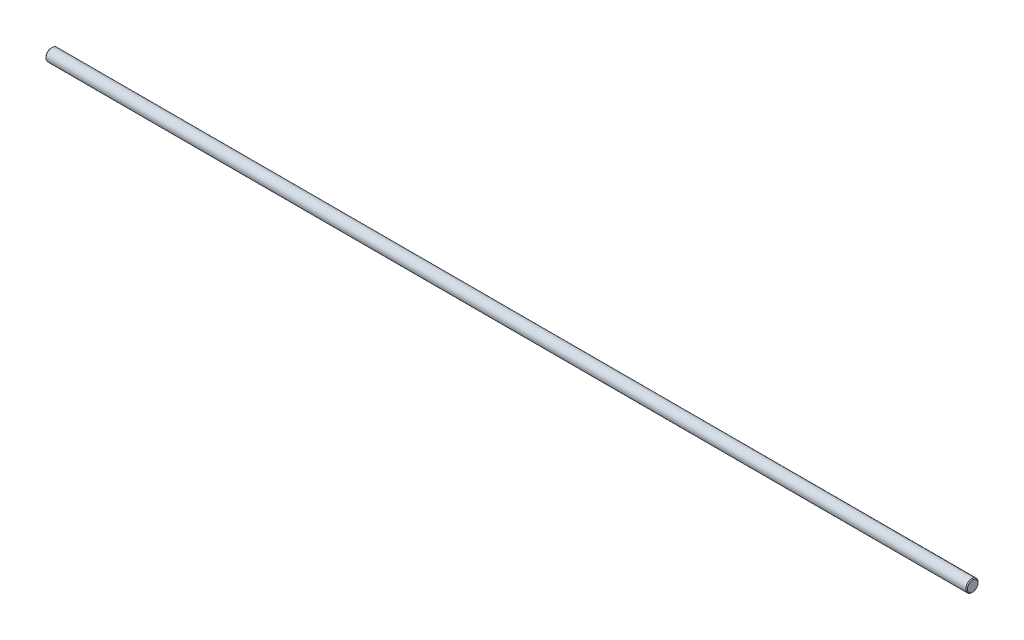
ISO-10303-21;
HEADER;
FILE_DESCRIPTION(('STEP AP214'),'2;1');
FILE_NAME('part.step','',(''),(''),'','','');
FILE_SCHEMA(('AUTOMOTIVE_DESIGN { 1 0 10303 214 1 1 1 1 }'));
ENDSEC;
DATA;
#1=APPLICATION_CONTEXT('core data for automotive mechanical design processes');
#2=APPLICATION_PROTOCOL_DEFINITION('international standard','automotive_design',2000,#1);
#3=PRODUCT_CONTEXT('',#1,'mechanical');
#4=PRODUCT('Part','Part','',(#3));
#5=PRODUCT_RELATED_PRODUCT_CATEGORY('part','',(#4));
#6=PRODUCT_DEFINITION_FORMATION('','',#4);
#7=PRODUCT_DEFINITION_CONTEXT('part definition',#1,'design');
#8=PRODUCT_DEFINITION('design','',#6,#7);
#9=PRODUCT_DEFINITION_SHAPE('','',#8);
#10=(LENGTH_UNIT() NAMED_UNIT(*) SI_UNIT(.MILLI.,.METRE.));
#11=(NAMED_UNIT(*) PLANE_ANGLE_UNIT() SI_UNIT($,.RADIAN.));
#12=(NAMED_UNIT(*) SI_UNIT($,.STERADIAN.) SOLID_ANGLE_UNIT());
#13=UNCERTAINTY_MEASURE_WITH_UNIT(LENGTH_MEASURE(1.E-05),#10,'distance_accuracy_value','');
#14=(GEOMETRIC_REPRESENTATION_CONTEXT(3) GLOBAL_UNCERTAINTY_ASSIGNED_CONTEXT((#13)) GLOBAL_UNIT_ASSIGNED_CONTEXT((#10,
#11,#12)) REPRESENTATION_CONTEXT('',''));
#15=CARTESIAN_POINT('',(0.,0.,0.));
#16=DIRECTION('',(0.,0.,1.));
#17=DIRECTION('',(1.,0.,0.));
#18=AXIS2_PLACEMENT_3D('',#15,#16,#17);
#19=CARTESIAN_POINT('',(226.,0.,0.));
#20=DIRECTION('',(-1.,0.,0.));
#21=DIRECTION('',(0.,0.,1.));
#22=AXIS2_PLACEMENT_3D('',#19,#20,#21);
#23=CYLINDRICAL_SURFACE('',#22,1.5);
#24=CARTESIAN_POINT('',(0.199999999999978,0.,0.));
#25=DIRECTION('',(1.,0.,0.));
#26=DIRECTION('',(0.,0.,-1.));
#27=AXIS2_PLACEMENT_3D('',#24,#25,#26);
#28=CIRCLE('',#27,1.5);
#29=CARTESIAN_POINT('',(0.199999999999978,0.,-1.5));
#30=VERTEX_POINT('',#29);
#31=EDGE_CURVE('E41',#30,#30,#28,.T.);
#32=ORIENTED_EDGE('',*,*,#31,.T.);
#33=EDGE_LOOP('',(#32));
#34=FACE_BOUND('',#33,.T.);
#35=CARTESIAN_POINT('',(225.8,0.,0.));
#36=DIRECTION('',(1.,0.,0.));
#37=DIRECTION('',(0.,0.,-1.));
#38=AXIS2_PLACEMENT_3D('',#35,#36,#37);
#39=CIRCLE('',#38,1.5);
#40=CARTESIAN_POINT('',(225.8,0.,-1.5));
#41=VERTEX_POINT('',#40);
#42=EDGE_CURVE('E45',#41,#41,#39,.F.);
#43=ORIENTED_EDGE('',*,*,#42,.T.);
#44=EDGE_LOOP('',(#43));
#45=FACE_BOUND('',#44,.T.);
#46=ADVANCED_FACE('F30',(#34,#45),#23,.T.);
#47=CARTESIAN_POINT('',(226.,0.,0.));
#48=DIRECTION('',(1.,0.,0.));
#49=DIRECTION('',(0.,0.,-1.));
#50=AXIS2_PLACEMENT_3D('',#47,#48,#49);
#51=PLANE('',#50);
#52=CARTESIAN_POINT('',(226.,0.,0.));
#53=DIRECTION('',(1.,0.,0.));
#54=DIRECTION('',(0.,0.,-1.));
#55=AXIS2_PLACEMENT_3D('',#52,#53,#54);
#56=CIRCLE('',#55,1.3);
#57=CARTESIAN_POINT('',(226.,0.,-1.3));
#58=VERTEX_POINT('',#57);
#59=EDGE_CURVE('E10',#58,#58,#56,.T.);
#60=ORIENTED_EDGE('',*,*,#59,.T.);
#61=EDGE_LOOP('',(#60));
#62=FACE_BOUND('',#61,.T.);
#63=ADVANCED_FACE('F61',(#62),#51,.T.);
#64=CARTESIAN_POINT('',(0.,0.,0.));
#65=DIRECTION('',(1.,0.,0.));
#66=DIRECTION('',(0.,0.,-1.));
#67=AXIS2_PLACEMENT_3D('',#64,#65,#66);
#68=PLANE('',#67);
#69=CARTESIAN_POINT('',(0.,0.,0.));
#70=DIRECTION('',(1.,0.,0.));
#71=DIRECTION('',(0.,0.,-1.));
#72=AXIS2_PLACEMENT_3D('',#69,#70,#71);
#73=CIRCLE('',#72,1.3);
#74=CARTESIAN_POINT('',(0.,0.,-1.3));
#75=VERTEX_POINT('',#74);
#76=EDGE_CURVE('E37',#75,#75,#73,.F.);
#77=ORIENTED_EDGE('',*,*,#76,.T.);
#78=EDGE_LOOP('',(#77));
#79=FACE_BOUND('',#78,.T.);
#80=ADVANCED_FACE('F58',(#79),#68,.F.);
#81=CARTESIAN_POINT('',(0.199999999999978,0.,0.));
#82=DIRECTION('',(1.,0.,0.));
#83=DIRECTION('',(0.,0.,-1.));
#84=AXIS2_PLACEMENT_3D('',#81,#82,#83);
#85=CONICAL_SURFACE('',#84,1.5,0.785398163397514);
#86=ORIENTED_EDGE('',*,*,#76,.F.);
#87=EDGE_LOOP('',(#86));
#88=FACE_BOUND('',#87,.T.);
#89=ORIENTED_EDGE('',*,*,#31,.F.);
#90=EDGE_LOOP('',(#89));
#91=FACE_BOUND('',#90,.T.);
#92=ADVANCED_FACE('F54',(#88,#91),#85,.T.);
#93=CARTESIAN_POINT('',(226.,0.,0.));
#94=DIRECTION('',(-1.,0.,0.));
#95=DIRECTION('',(0.,0.,1.));
#96=AXIS2_PLACEMENT_3D('',#93,#94,#95);
#97=CONICAL_SURFACE('',#96,1.3,0.785398163397446);
#98=ORIENTED_EDGE('',*,*,#42,.F.);
#99=EDGE_LOOP('',(#98));
#100=FACE_BOUND('',#99,.T.);
#101=ORIENTED_EDGE('',*,*,#59,.F.);
#102=EDGE_LOOP('',(#101));
#103=FACE_BOUND('',#102,.T.);
#104=ADVANCED_FACE('F32',(#100,#103),#97,.T.);
#105=CLOSED_SHELL('',(#46,#63,#80,#92,#104));
#106=MANIFOLD_SOLID_BREP('B2',#105);
#107=ADVANCED_BREP_SHAPE_REPRESENTATION('',(#18,#106),#14);
#108=SHAPE_DEFINITION_REPRESENTATION(#9,#107);
ENDSEC;
END-ISO-10303-21;
